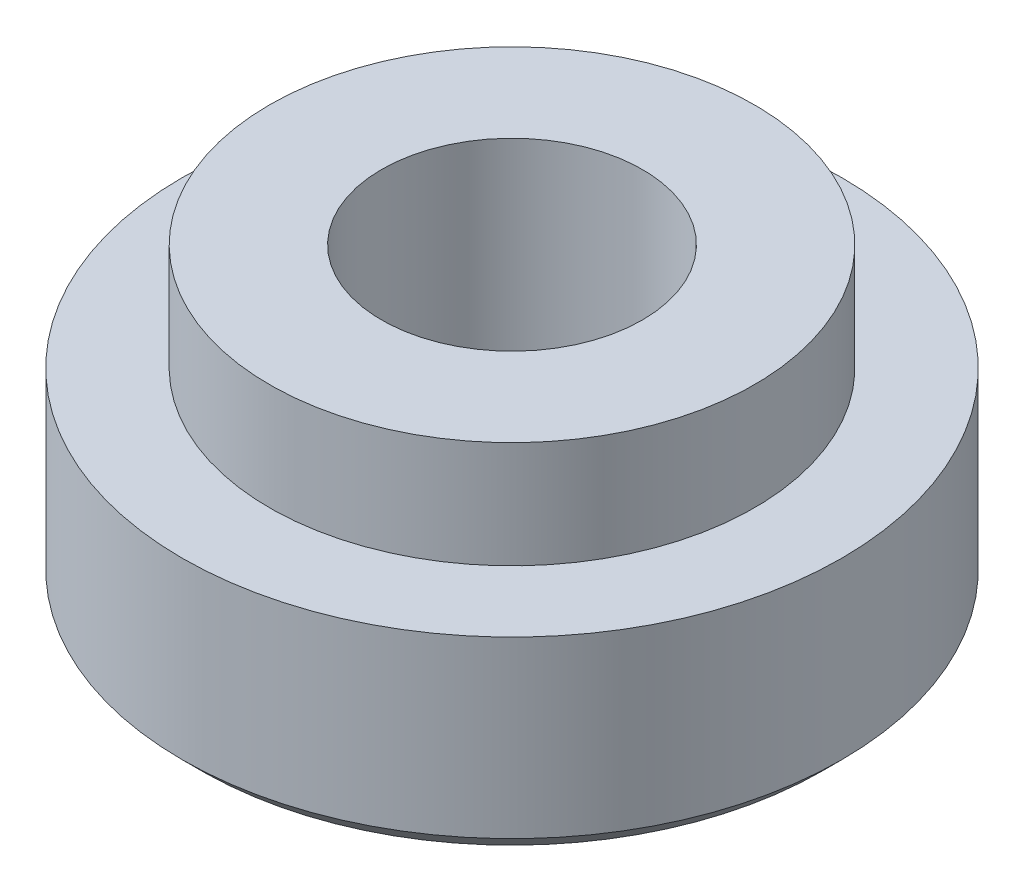
ISO-10303-21;
HEADER;
FILE_DESCRIPTION(('STEP AP214'),'2;1');
FILE_NAME('part.step','',(''),(''),'','','');
FILE_SCHEMA(('AUTOMOTIVE_DESIGN { 1 0 10303 214 1 1 1 1 }'));
ENDSEC;
DATA;
#1=APPLICATION_CONTEXT('core data for automotive mechanical design processes');
#2=APPLICATION_PROTOCOL_DEFINITION('international standard','automotive_design',2000,#1);
#3=PRODUCT_CONTEXT('',#1,'mechanical');
#4=PRODUCT('Part','Part','',(#3));
#5=PRODUCT_RELATED_PRODUCT_CATEGORY('part','',(#4));
#6=PRODUCT_DEFINITION_FORMATION('','',#4);
#7=PRODUCT_DEFINITION_CONTEXT('part definition',#1,'design');
#8=PRODUCT_DEFINITION('design','',#6,#7);
#9=PRODUCT_DEFINITION_SHAPE('','',#8);
#10=(LENGTH_UNIT() NAMED_UNIT(*) SI_UNIT(.MILLI.,.METRE.));
#11=(NAMED_UNIT(*) PLANE_ANGLE_UNIT() SI_UNIT($,.RADIAN.));
#12=(NAMED_UNIT(*) SI_UNIT($,.STERADIAN.) SOLID_ANGLE_UNIT());
#13=UNCERTAINTY_MEASURE_WITH_UNIT(LENGTH_MEASURE(1.E-05),#10,'distance_accuracy_value','');
#14=(GEOMETRIC_REPRESENTATION_CONTEXT(3) GLOBAL_UNCERTAINTY_ASSIGNED_CONTEXT((#13)) GLOBAL_UNIT_ASSIGNED_CONTEXT((#10,
#11,#12)) REPRESENTATION_CONTEXT('',''));
#15=CARTESIAN_POINT('',(0.,0.,0.));
#16=DIRECTION('',(0.,0.,1.));
#17=DIRECTION('',(1.,0.,0.));
#18=AXIS2_PLACEMENT_3D('',#15,#16,#17);
#19=CARTESIAN_POINT('',(3.175,3.937,0.));
#20=DIRECTION('',(0.,1.,0.));
#21=DIRECTION('',(1.,0.,0.));
#22=AXIS2_PLACEMENT_3D('',#19,#20,#21);
#23=PLANE('',#22);
#24=CARTESIAN_POINT('',(0.,3.937,0.));
#25=DIRECTION('',(0.,-1.,0.));
#26=DIRECTION('',(1.,0.,0.));
#27=AXIS2_PLACEMENT_3D('',#24,#25,#26);
#28=CIRCLE('',#27,1.70815);
#29=CARTESIAN_POINT('',(-1.70815,3.937,0.));
#30=VERTEX_POINT('',#29);
#31=EDGE_CURVE('E11',#30,#30,#28,.T.);
#32=ORIENTED_EDGE('',*,*,#31,.T.);
#33=EDGE_LOOP('',(#32));
#34=FACE_BOUND('',#33,.T.);
#35=CARTESIAN_POINT('',(0.,3.937,0.));
#36=DIRECTION('',(0.,-1.,0.));
#37=DIRECTION('',(1.,0.,0.));
#38=AXIS2_PLACEMENT_3D('',#35,#36,#37);
#39=CIRCLE('',#38,3.175);
#40=CARTESIAN_POINT('',(-3.175,3.937,0.));
#41=VERTEX_POINT('',#40);
#42=EDGE_CURVE('E75',#41,#41,#39,.T.);
#43=ORIENTED_EDGE('',*,*,#42,.F.);
#44=EDGE_LOOP('',(#43));
#45=FACE_BOUND('',#44,.T.);
#46=ADVANCED_FACE('F16',(#34,#45),#23,.T.);
#47=CARTESIAN_POINT('',(0.,1.9685,0.));
#48=DIRECTION('',(0.,-1.,0.));
#49=DIRECTION('',(1.,0.,0.));
#50=AXIS2_PLACEMENT_3D('',#47,#48,#49);
#51=CYLINDRICAL_SURFACE('',#50,1.70815);
#52=CARTESIAN_POINT('',(0.,0.,0.));
#53=DIRECTION('',(0.,-1.,0.));
#54=DIRECTION('',(1.,0.,0.));
#55=AXIS2_PLACEMENT_3D('',#52,#53,#54);
#56=CIRCLE('',#55,1.70815);
#57=CARTESIAN_POINT('',(-1.70815,0.,0.));
#58=VERTEX_POINT('',#57);
#59=EDGE_CURVE('E90',#58,#58,#56,.T.);
#60=ORIENTED_EDGE('',*,*,#59,.T.);
#61=DIRECTION('',(0.,1.,0.));
#62=VECTOR('',#61,1.);
#63=CARTESIAN_POINT('',(-1.70815,1.9685,0.));
#64=LINE('',#63,#62);
#65=EDGE_CURVE('E27',#58,#30,#64,.T.);
#66=ORIENTED_EDGE('',*,*,#65,.T.);
#67=ORIENTED_EDGE('',*,*,#31,.F.);
#68=ORIENTED_EDGE('',*,*,#65,.F.);
#69=EDGE_LOOP('',(#60,#66,#67,#68));
#70=FACE_BOUND('',#69,.T.);
#71=ADVANCED_FACE('F103',(#70),#51,.F.);
#72=CARTESIAN_POINT('',(4.318,2.54,0.));
#73=DIRECTION('',(0.,1.,0.));
#74=DIRECTION('',(1.,0.,0.));
#75=AXIS2_PLACEMENT_3D('',#72,#73,#74);
#76=PLANE('',#75);
#77=CARTESIAN_POINT('',(0.,2.54,0.));
#78=DIRECTION('',(0.,-1.,0.));
#79=DIRECTION('',(1.,0.,0.));
#80=AXIS2_PLACEMENT_3D('',#77,#78,#79);
#81=CIRCLE('',#80,3.175);
#82=CARTESIAN_POINT('',(-3.175,2.54,0.));
#83=VERTEX_POINT('',#82);
#84=EDGE_CURVE('E74',#83,#83,#81,.T.);
#85=ORIENTED_EDGE('',*,*,#84,.T.);
#86=EDGE_LOOP('',(#85));
#87=FACE_BOUND('',#86,.T.);
#88=CARTESIAN_POINT('',(0.,2.54,0.));
#89=DIRECTION('',(0.,-1.,0.));
#90=DIRECTION('',(1.,0.,0.));
#91=AXIS2_PLACEMENT_3D('',#88,#89,#90);
#92=CIRCLE('',#91,4.318);
#93=CARTESIAN_POINT('',(-4.318,2.54,0.));
#94=VERTEX_POINT('',#93);
#95=EDGE_CURVE('E82',#94,#94,#92,.T.);
#96=ORIENTED_EDGE('',*,*,#95,.F.);
#97=EDGE_LOOP('',(#96));
#98=FACE_BOUND('',#97,.T.);
#99=ADVANCED_FACE('F132',(#87,#98),#76,.T.);
#100=CARTESIAN_POINT('',(0.,3.2385,0.));
#101=DIRECTION('',(0.,-1.,0.));
#102=DIRECTION('',(1.,0.,0.));
#103=AXIS2_PLACEMENT_3D('',#100,#101,#102);
#104=CYLINDRICAL_SURFACE('',#103,3.175);
#105=ORIENTED_EDGE('',*,*,#84,.F.);
#106=DIRECTION('',(0.,1.,0.));
#107=VECTOR('',#106,1.);
#108=CARTESIAN_POINT('',(-3.175,3.2385,0.));
#109=LINE('',#108,#107);
#110=EDGE_CURVE('E76',#83,#41,#109,.T.);
#111=ORIENTED_EDGE('',*,*,#110,.T.);
#112=ORIENTED_EDGE('',*,*,#42,.T.);
#113=ORIENTED_EDGE('',*,*,#110,.F.);
#114=EDGE_LOOP('',(#105,#111,#112,#113));
#115=FACE_BOUND('',#114,.T.);
#116=ADVANCED_FACE('F123',(#115),#104,.T.);
#117=CARTESIAN_POINT('',(1.905,0.,0.));
#118=DIRECTION('',(0.,-1.,0.));
#119=DIRECTION('',(0.,0.,-1.));
#120=AXIS2_PLACEMENT_3D('',#117,#118,#119);
#121=PLANE('',#120);
#122=ORIENTED_EDGE('',*,*,#59,.F.);
#123=EDGE_LOOP('',(#122));
#124=FACE_BOUND('',#123,.T.);
#125=CARTESIAN_POINT('',(0.,0.,0.));
#126=DIRECTION('',(0.,1.,0.));
#127=DIRECTION('',(-1.,0.,0.));
#128=AXIS2_PLACEMENT_3D('',#125,#126,#127);
#129=CIRCLE('',#128,4.064);
#130=CARTESIAN_POINT('',(4.064,0.,0.));
#131=VERTEX_POINT('',#130);
#132=EDGE_CURVE('E20',#131,#131,#129,.T.);
#133=ORIENTED_EDGE('',*,*,#132,.F.);
#134=EDGE_LOOP('',(#133));
#135=FACE_BOUND('',#134,.T.);
#136=ADVANCED_FACE('F116',(#124,#135),#121,.T.);
#137=CARTESIAN_POINT('',(0.,1.27,0.));
#138=DIRECTION('',(0.,-1.,0.));
#139=DIRECTION('',(1.,0.,0.));
#140=AXIS2_PLACEMENT_3D('',#137,#138,#139);
#141=CYLINDRICAL_SURFACE('',#140,4.318);
#142=CARTESIAN_POINT('',(0.,0.254000000000006,0.));
#143=DIRECTION('',(0.,-1.,0.));
#144=DIRECTION('',(-1.,0.,0.));
#145=AXIS2_PLACEMENT_3D('',#142,#143,#144);
#146=CIRCLE('',#145,4.318);
#147=CARTESIAN_POINT('',(4.318,0.254000000000006,0.));
#148=VERTEX_POINT('',#147);
#149=CARTESIAN_POINT('',(-4.318,0.254000000000006,0.));
#150=VERTEX_POINT('',#149);
#151=EDGE_CURVE('E64',#148,#150,#146,.T.);
#152=ORIENTED_EDGE('',*,*,#151,.F.);
#153=CARTESIAN_POINT('',(0.,0.254000000000006,0.));
#154=DIRECTION('',(0.,-1.,0.));
#155=DIRECTION('',(-1.,0.,0.));
#156=AXIS2_PLACEMENT_3D('',#153,#154,#155);
#157=CIRCLE('',#156,4.318);
#158=EDGE_CURVE('E61',#150,#148,#157,.T.);
#159=ORIENTED_EDGE('',*,*,#158,.F.);
#160=DIRECTION('',(0.,1.,0.));
#161=VECTOR('',#160,1.);
#162=CARTESIAN_POINT('',(-4.318,1.27,0.));
#163=LINE('',#162,#161);
#164=EDGE_CURVE('E78',#150,#94,#163,.T.);
#165=ORIENTED_EDGE('',*,*,#164,.T.);
#166=ORIENTED_EDGE('',*,*,#95,.T.);
#167=ORIENTED_EDGE('',*,*,#164,.F.);
#168=EDGE_LOOP('',(#152,#159,#165,#166,#167));
#169=FACE_BOUND('',#168,.T.);
#170=ADVANCED_FACE('F114',(#169),#141,.T.);
#171=CARTESIAN_POINT('',(0.,0.127000000000004,0.));
#172=DIRECTION('',(0.,1.,0.));
#173=DIRECTION('',(-1.,0.,0.));
#174=AXIS2_PLACEMENT_3D('',#171,#172,#173);
#175=CONICAL_SURFACE('',#174,4.191,0.785398163397441);
#176=ORIENTED_EDGE('',*,*,#132,.T.);
#177=DIRECTION('',(0.707106781186542,0.707106781186553,0.));
#178=VECTOR('',#177,1.);
#179=CARTESIAN_POINT('',(4.191,0.127000000000004,0.));
#180=LINE('',#179,#178);
#181=EDGE_CURVE('E57',#131,#148,#180,.T.);
#182=ORIENTED_EDGE('',*,*,#181,.T.);
#183=ORIENTED_EDGE('',*,*,#151,.T.);
#184=ORIENTED_EDGE('',*,*,#158,.T.);
#185=ORIENTED_EDGE('',*,*,#181,.F.);
#186=EDGE_LOOP('',(#176,#182,#183,#184,#185));
#187=FACE_BOUND('',#186,.T.);
#188=ADVANCED_FACE('F18',(#187),#175,.T.);
#189=CLOSED_SHELL('',(#46,#71,#99,#116,#136,#170,#188));
#190=MANIFOLD_SOLID_BREP('B1',#189);
#191=ADVANCED_BREP_SHAPE_REPRESENTATION('',(#18,#190),#14);
#192=SHAPE_DEFINITION_REPRESENTATION(#9,#191);
ENDSEC;
END-ISO-10303-21;
